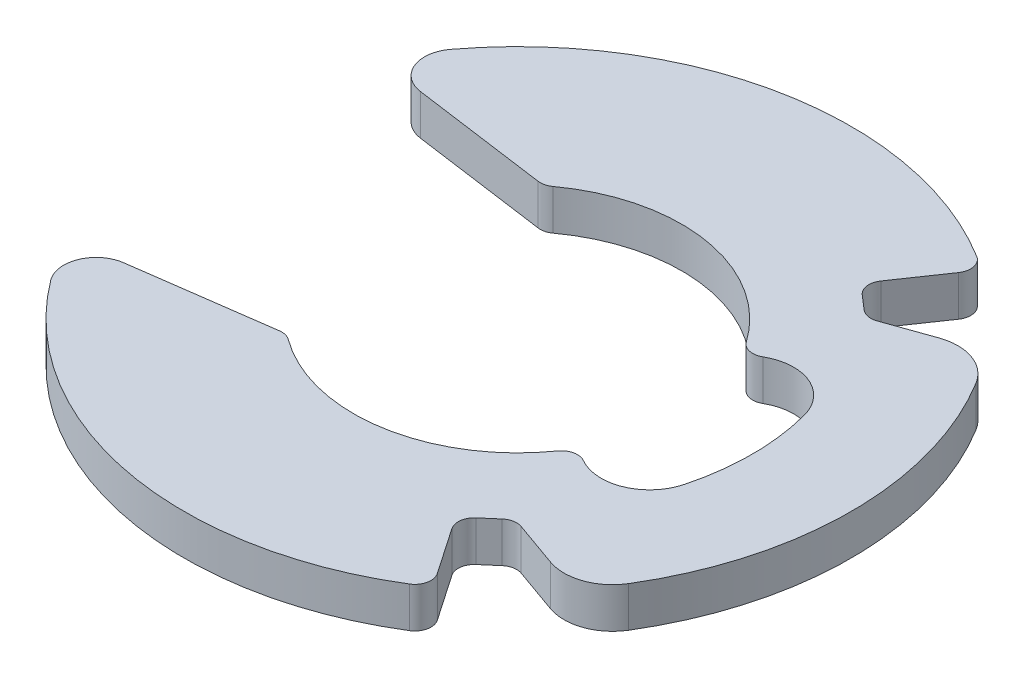
ISO-10303-21;
HEADER;
FILE_DESCRIPTION(('STEP AP214'),'2;1');
FILE_NAME('part.step','',(''),(''),'','','');
FILE_SCHEMA(('AUTOMOTIVE_DESIGN { 1 0 10303 214 1 1 1 1 }'));
ENDSEC;
DATA;
#1=APPLICATION_CONTEXT('core data for automotive mechanical design processes');
#2=APPLICATION_PROTOCOL_DEFINITION('international standard','automotive_design',2000,#1);
#3=PRODUCT_CONTEXT('',#1,'mechanical');
#4=PRODUCT('Part','Part','',(#3));
#5=PRODUCT_RELATED_PRODUCT_CATEGORY('part','',(#4));
#6=PRODUCT_DEFINITION_FORMATION('','',#4);
#7=PRODUCT_DEFINITION_CONTEXT('part definition',#1,'design');
#8=PRODUCT_DEFINITION('design','',#6,#7);
#9=PRODUCT_DEFINITION_SHAPE('','',#8);
#10=(LENGTH_UNIT() NAMED_UNIT(*) SI_UNIT(.MILLI.,.METRE.));
#11=(NAMED_UNIT(*) PLANE_ANGLE_UNIT() SI_UNIT($,.RADIAN.));
#12=(NAMED_UNIT(*) SI_UNIT($,.STERADIAN.) SOLID_ANGLE_UNIT());
#13=UNCERTAINTY_MEASURE_WITH_UNIT(LENGTH_MEASURE(1.E-05),#10,'distance_accuracy_value','');
#14=(GEOMETRIC_REPRESENTATION_CONTEXT(3) GLOBAL_UNCERTAINTY_ASSIGNED_CONTEXT((#13)) GLOBAL_UNIT_ASSIGNED_CONTEXT((#10,
#11,#12)) REPRESENTATION_CONTEXT('',''));
#15=CARTESIAN_POINT('',(0.,0.,0.));
#16=DIRECTION('',(0.,0.,1.));
#17=DIRECTION('',(1.,0.,0.));
#18=AXIS2_PLACEMENT_3D('',#15,#16,#17);
#19=CARTESIAN_POINT('',(-27.3204100145985,1.27,-7.53659958515381));
#20=DIRECTION('',(0.,1.,0.));
#21=DIRECTION('',(0.,0.,1.));
#22=AXIS2_PLACEMENT_3D('',#19,#20,#21);
#23=PLANE('',#22);
#24=DIRECTION('',(-0.56488243359,0.,0.825171398087355));
#25=VECTOR('',#24,1.);
#26=CARTESIAN_POINT('',(-22.6486653223571,1.27,-14.2734191629184));
#27=LINE('',#26,#25);
#28=CARTESIAN_POINT('',(-22.6486653223571,1.27,-14.2734191629184));
#29=VERTEX_POINT('',#28);
#30=CARTESIAN_POINT('',(-21.6539452914442,1.27,-15.7264905806244));
#31=VERTEX_POINT('',#30);
#32=EDGE_CURVE('E236',#29,#31,#27,.F.);
#33=ORIENTED_EDGE('',*,*,#32,.T.);
#34=CARTESIAN_POINT('',(-22.0731323616726,1.27,-16.0134508568881));
#35=DIRECTION('',(0.,-1.,0.));
#36=DIRECTION('',(0.,0.,-1.));
#37=AXIS2_PLACEMENT_3D('',#34,#35,#36);
#38=CIRCLE('',#37,0.507999999999998);
#39=CARTESIAN_POINT('',(-21.805755156428,1.27,-16.4453923229638));
#40=VERTEX_POINT('',#39);
#41=EDGE_CURVE('E217',#40,#31,#38,.T.);
#42=ORIENTED_EDGE('',*,*,#41,.F.);
#43=CARTESIAN_POINT('',(-27.3204100145985,1.27,-7.53659958515381));
#44=DIRECTION('',(0.,-1.,0.));
#45=DIRECTION('',(0.,0.,-1.));
#46=AXIS2_PLACEMENT_3D('',#43,#44,#45);
#47=CIRCLE('',#46,10.4775);
#48=CARTESIAN_POINT('',(-35.7109114644987,1.27,-13.8117483219746));
#49=VERTEX_POINT('',#48);
#50=EDGE_CURVE('E215',#49,#40,#47,.T.);
#51=ORIENTED_EDGE('',*,*,#50,.F.);
#52=CARTESIAN_POINT('',(-34.8972870814781,1.27,-13.2032490505253));
#53=DIRECTION('',(0.,-1.,0.));
#54=DIRECTION('',(0.,0.,-1.));
#55=AXIS2_PLACEMENT_3D('',#52,#53,#54);
#56=CIRCLE('',#55,1.016);
#57=CARTESIAN_POINT('',(-35.0366255018999,1.27,-12.196849127734));
#58=VERTEX_POINT('',#57);
#59=EDGE_CURVE('E20',#58,#49,#56,.T.);
#60=ORIENTED_EDGE('',*,*,#59,.F.);
#61=DIRECTION('',(-0.990551105109562,0.,-0.137144114588364));
#62=VECTOR('',#61,1.);
#63=CARTESIAN_POINT('',(-30.7386620738598,1.27,-11.6017860503912));
#64=LINE('',#63,#62);
#65=CARTESIAN_POINT('',(-30.7386620738598,1.27,-11.6017860503912));
#66=VERTEX_POINT('',#65);
#67=EDGE_CURVE('E232',#58,#66,#64,.F.);
#68=ORIENTED_EDGE('',*,*,#67,.T.);
#69=CARTESIAN_POINT('',(-30.6689928636489,1.27,-12.1049860117869));
#70=DIRECTION('',(0.,-1.,0.));
#71=DIRECTION('',(0.,0.,-1.));
#72=AXIS2_PLACEMENT_3D('',#69,#70,#71);
#73=CIRCLE('',#72,0.508000000000002);
#74=CARTESIAN_POINT('',(-30.3686715318955,1.27,-11.6952652560351));
#75=VERTEX_POINT('',#74);
#76=EDGE_CURVE('E266',#75,#66,#73,.T.);
#77=ORIENTED_EDGE('',*,*,#76,.F.);
#78=CARTESIAN_POINT('',(-27.3204100145985,1.27,-7.53659958515381));
#79=DIRECTION('',(0.,-1.,0.));
#80=DIRECTION('',(0.,0.,-1.));
#81=AXIS2_PLACEMENT_3D('',#78,#79,#80);
#82=CIRCLE('',#81,5.1562);
#83=CARTESIAN_POINT('',(-23.1042244001931,1.27,-10.5047938687007));
#84=VERTEX_POINT('',#83);
#85=EDGE_CURVE('E377',#75,#84,#82,.T.);
#86=ORIENTED_EDGE('',*,*,#85,.T.);
#87=CARTESIAN_POINT('',(-22.6888366549314,1.27,-10.7972268030403));
#88=DIRECTION('',(0.,-1.,0.));
#89=DIRECTION('',(0.,0.,-1.));
#90=AXIS2_PLACEMENT_3D('',#87,#88,#89);
#91=CIRCLE('',#90,0.508);
#92=CARTESIAN_POINT('',(-22.4351958276358,1.27,-10.3570787248566));
#93=VERTEX_POINT('',#92);
#94=EDGE_CURVE('E374',#93,#84,#91,.T.);
#95=ORIENTED_EDGE('',*,*,#94,.F.);
#96=CARTESIAN_POINT('',(-21.6742733457491,1.27,-9.03663449030548));
#97=DIRECTION('',(0.,-1.,0.));
#98=DIRECTION('',(0.,0.,-1.));
#99=AXIS2_PLACEMENT_3D('',#96,#97,#98);
#100=CIRCLE('',#99,1.524);
#101=CARTESIAN_POINT('',(-20.2013681277883,1.27,-9.42794794382331));
#102=VERTEX_POINT('',#101);
#103=EDGE_CURVE('E371',#93,#102,#100,.T.);
#104=ORIENTED_EDGE('',*,*,#103,.T.);
#105=CARTESIAN_POINT('',(-27.3204100145985,1.27,-7.53659958515381));
#106=DIRECTION('',(0.,-1.,0.));
#107=DIRECTION('',(0.,0.,-1.));
#108=AXIS2_PLACEMENT_3D('',#105,#106,#107);
#109=CIRCLE('',#108,7.366);
#110=CARTESIAN_POINT('',(-20.2013681277883,1.27,-5.64525122648429));
#111=VERTEX_POINT('',#110);
#112=EDGE_CURVE('E368',#102,#111,#109,.T.);
#113=ORIENTED_EDGE('',*,*,#112,.T.);
#114=CARTESIAN_POINT('',(-21.6742733457491,1.27,-6.03656468000212));
#115=DIRECTION('',(0.,-1.,0.));
#116=DIRECTION('',(0.,0.,-1.));
#117=AXIS2_PLACEMENT_3D('',#114,#115,#116);
#118=CIRCLE('',#117,1.524);
#119=CARTESIAN_POINT('',(-22.4351958276358,1.27,-4.71612044545101));
#120=VERTEX_POINT('',#119);
#121=EDGE_CURVE('E364',#111,#120,#118,.T.);
#122=ORIENTED_EDGE('',*,*,#121,.T.);
#123=CARTESIAN_POINT('',(-22.6888366549314,1.27,-4.27597236726731));
#124=DIRECTION('',(0.,-1.,0.));
#125=DIRECTION('',(0.,0.,-1.));
#126=AXIS2_PLACEMENT_3D('',#123,#124,#125);
#127=CIRCLE('',#126,0.508);
#128=CARTESIAN_POINT('',(-23.1042244001931,1.27,-4.56840530160691));
#129=VERTEX_POINT('',#128);
#130=EDGE_CURVE('E361',#129,#120,#127,.T.);
#131=ORIENTED_EDGE('',*,*,#130,.F.);
#132=CARTESIAN_POINT('',(-27.3204100145985,1.27,-7.53659958515381));
#133=DIRECTION('',(0.,-1.,0.));
#134=DIRECTION('',(0.,0.,-1.));
#135=AXIS2_PLACEMENT_3D('',#132,#133,#134);
#136=CIRCLE('',#135,5.1562);
#137=CARTESIAN_POINT('',(-30.3686715318955,1.27,-3.37793391427254));
#138=VERTEX_POINT('',#137);
#139=EDGE_CURVE('E357',#129,#138,#136,.T.);
#140=ORIENTED_EDGE('',*,*,#139,.T.);
#141=CARTESIAN_POINT('',(-30.6689928636489,1.27,-2.9682131585207));
#142=DIRECTION('',(0.,-1.,0.));
#143=DIRECTION('',(0.,0.,-1.));
#144=AXIS2_PLACEMENT_3D('',#141,#142,#143);
#145=CIRCLE('',#144,0.508);
#146=CARTESIAN_POINT('',(-30.7386620738598,1.27,-3.47141311991636));
#147=VERTEX_POINT('',#146);
#148=EDGE_CURVE('E354',#147,#138,#145,.T.);
#149=ORIENTED_EDGE('',*,*,#148,.F.);
#150=DIRECTION('',(0.990551105109562,0.,-0.137144114588364));
#151=VECTOR('',#150,1.);
#152=CARTESIAN_POINT('',(-35.0366255018998,1.27,-2.87635004257364));
#153=LINE('',#152,#151);
#154=CARTESIAN_POINT('',(-35.0366255018998,1.27,-2.87635004257364));
#155=VERTEX_POINT('',#154);
#156=EDGE_CURVE('E261',#147,#155,#153,.F.);
#157=ORIENTED_EDGE('',*,*,#156,.T.);
#158=CARTESIAN_POINT('',(-34.8972870814781,1.27,-1.86995011978233));
#159=DIRECTION('',(0.,-1.,0.));
#160=DIRECTION('',(0.,0.,-1.));
#161=AXIS2_PLACEMENT_3D('',#158,#159,#160);
#162=CIRCLE('',#161,1.016);
#163=CARTESIAN_POINT('',(-35.7109114644987,1.27,-1.26145084833304));
#164=VERTEX_POINT('',#163);
#165=EDGE_CURVE('E264',#164,#155,#162,.T.);
#166=ORIENTED_EDGE('',*,*,#165,.F.);
#167=CARTESIAN_POINT('',(-27.3204100145985,1.27,-7.53659958515381));
#168=DIRECTION('',(0.,-1.,0.));
#169=DIRECTION('',(0.,0.,-1.));
#170=AXIS2_PLACEMENT_3D('',#167,#168,#169);
#171=CIRCLE('',#170,10.4775);
#172=CARTESIAN_POINT('',(-21.805755156428,1.27,1.37219315265618));
#173=VERTEX_POINT('',#172);
#174=EDGE_CURVE('E350',#173,#164,#171,.T.);
#175=ORIENTED_EDGE('',*,*,#174,.F.);
#176=CARTESIAN_POINT('',(-22.0731323616726,1.27,0.940251686580542));
#177=DIRECTION('',(0.,-1.,0.));
#178=DIRECTION('',(0.,0.,-1.));
#179=AXIS2_PLACEMENT_3D('',#176,#177,#178);
#180=CIRCLE('',#179,0.508000000000001);
#181=CARTESIAN_POINT('',(-21.6539452914442,1.27,0.653291410316822));
#182=VERTEX_POINT('',#181);
#183=EDGE_CURVE('E346',#182,#173,#180,.T.);
#184=ORIENTED_EDGE('',*,*,#183,.F.);
#185=DIRECTION('',(0.564882433590001,0.,0.825171398087354));
#186=VECTOR('',#185,1.);
#187=CARTESIAN_POINT('',(-22.6486653223571,1.27,-0.79978000738918));
#188=LINE('',#187,#186);
#189=CARTESIAN_POINT('',(-22.6486653223571,1.27,-0.799780007389181));
#190=VERTEX_POINT('',#189);
#191=EDGE_CURVE('E257',#182,#190,#188,.F.);
#192=ORIENTED_EDGE('',*,*,#191,.T.);
#193=CARTESIAN_POINT('',(-22.2294782521287,1.27,-1.0867402836529));
#194=DIRECTION('',(0.,-1.,0.));
#195=DIRECTION('',(0.,0.,-1.));
#196=AXIS2_PLACEMENT_3D('',#193,#194,#195);
#197=CIRCLE('',#196,0.507999999999999);
#198=CARTESIAN_POINT('',(-22.56117158014,1.27,-1.471504544146));
#199=VERTEX_POINT('',#198);
#200=EDGE_CURVE('E344',#190,#199,#197,.T.);
#201=ORIENTED_EDGE('',*,*,#200,.T.);
#202=DIRECTION('',(-0.757409961600577,0.,0.652939622069462));
#203=VECTOR('',#202,1.);
#204=CARTESIAN_POINT('',(-22.1206645642395,1.27,-1.85125197164637));
#205=LINE('',#204,#203);
#206=CARTESIAN_POINT('',(-22.1206645642395,1.27,-1.85125197164637));
#207=VERTEX_POINT('',#206);
#208=EDGE_CURVE('E252',#199,#207,#205,.F.);
#209=ORIENTED_EDGE('',*,*,#208,.T.);
#210=CARTESIAN_POINT('',(-21.7889712362282,1.27,-1.46648771115328));
#211=DIRECTION('',(0.,-1.,0.));
#212=DIRECTION('',(0.,0.,-1.));
#213=AXIS2_PLACEMENT_3D('',#210,#211,#212);
#214=CIRCLE('',#213,0.508);
#215=CARTESIAN_POINT('',(-21.6191707895771,1.27,-1.94526929843193));
#216=VERTEX_POINT('',#215);
#217=EDGE_CURVE('E342',#207,#216,#214,.T.);
#218=ORIENTED_EDGE('',*,*,#217,.T.);
#219=DIRECTION('',(-0.942483439524914,0.,-0.334252847738487));
#220=VECTOR('',#219,1.);
#221=CARTESIAN_POINT('',(-20.1864675997461,1.27,-1.43715944622443));
#222=LINE('',#221,#220);
#223=CARTESIAN_POINT('',(-20.1864675997461,1.27,-1.43715944622443));
#224=VERTEX_POINT('',#223);
#225=EDGE_CURVE('E247',#216,#224,#222,.F.);
#226=ORIENTED_EDGE('',*,*,#225,.T.);
#227=CARTESIAN_POINT('',(-19.6770662597926,1.27,-2.8735042080604));
#228=DIRECTION('',(0.,-1.,0.));
#229=DIRECTION('',(0.,0.,-1.));
#230=AXIS2_PLACEMENT_3D('',#227,#228,#229);
#231=CIRCLE('',#230,1.524);
#232=CARTESIAN_POINT('',(-18.3760715781236,1.27,-2.07978584600195));
#233=VERTEX_POINT('',#232);
#234=EDGE_CURVE('E250',#233,#224,#231,.T.);
#235=ORIENTED_EDGE('',*,*,#234,.F.);
#236=CARTESIAN_POINT('',(-27.3204100145985,1.27,-7.53659958515381));
#237=DIRECTION('',(0.,-1.,0.));
#238=DIRECTION('',(0.,0.,-1.));
#239=AXIS2_PLACEMENT_3D('',#236,#237,#238);
#240=CIRCLE('',#239,10.4775);
#241=CARTESIAN_POINT('',(-18.3760715781235,1.27,-12.9934133243057));
#242=VERTEX_POINT('',#241);
#243=EDGE_CURVE('E337',#242,#233,#240,.T.);
#244=ORIENTED_EDGE('',*,*,#243,.F.);
#245=CARTESIAN_POINT('',(-19.6770662597926,1.27,-12.1996949622472));
#246=DIRECTION('',(0.,-1.,0.));
#247=DIRECTION('',(0.,0.,-1.));
#248=AXIS2_PLACEMENT_3D('',#245,#246,#247);
#249=CIRCLE('',#248,1.524);
#250=CARTESIAN_POINT('',(-20.1864675997461,1.27,-13.6360397240832));
#251=VERTEX_POINT('',#250);
#252=EDGE_CURVE('E334',#251,#242,#249,.T.);
#253=ORIENTED_EDGE('',*,*,#252,.F.);
#254=DIRECTION('',(0.942483439524914,0.,-0.334252847738487));
#255=VECTOR('',#254,1.);
#256=CARTESIAN_POINT('',(-20.1864675997461,1.27,-13.6360397240832));
#257=LINE('',#256,#255);
#258=CARTESIAN_POINT('',(-21.6191707895771,1.27,-13.1279298718757));
#259=VERTEX_POINT('',#258);
#260=EDGE_CURVE('E243',#251,#259,#257,.F.);
#261=ORIENTED_EDGE('',*,*,#260,.T.);
#262=CARTESIAN_POINT('',(-21.7889712362282,1.27,-13.6067114591543));
#263=DIRECTION('',(0.,-1.,0.));
#264=DIRECTION('',(0.,0.,-1.));
#265=AXIS2_PLACEMENT_3D('',#262,#263,#264);
#266=CIRCLE('',#265,0.508000000000002);
#267=CARTESIAN_POINT('',(-22.1206645642395,1.27,-13.2219471986612));
#268=VERTEX_POINT('',#267);
#269=EDGE_CURVE('E332',#259,#268,#266,.T.);
#270=ORIENTED_EDGE('',*,*,#269,.T.);
#271=DIRECTION('',(0.757409961600575,0.,0.652939622069465));
#272=VECTOR('',#271,1.);
#273=CARTESIAN_POINT('',(-22.1206645642395,1.27,-13.2219471986612));
#274=LINE('',#273,#272);
#275=CARTESIAN_POINT('',(-22.56117158014,1.27,-13.6016946261616));
#276=VERTEX_POINT('',#275);
#277=EDGE_CURVE('E239',#268,#276,#274,.F.);
#278=ORIENTED_EDGE('',*,*,#277,.T.);
#279=CARTESIAN_POINT('',(-22.2294782521287,1.27,-13.9864588866547));
#280=DIRECTION('',(0.,-1.,0.));
#281=DIRECTION('',(0.,0.,-1.));
#282=AXIS2_PLACEMENT_3D('',#279,#280,#281);
#283=CIRCLE('',#282,0.508);
#284=EDGE_CURVE('E330',#276,#29,#283,.T.);
#285=ORIENTED_EDGE('',*,*,#284,.T.);
#286=EDGE_LOOP('',(#33,#42,#51,#60,#68,#77,#86,#95,#104,#113,#122,#131,#140,#149,#157,#166,#175,
#184,#192,#201,#209,#218,#226,#235,#244,#253,#261,#270,#278,#285));
#287=FACE_BOUND('',#286,.T.);
#288=ADVANCED_FACE('F17',(#287),#23,.T.);
#289=CARTESIAN_POINT('',(-34.8972870814781,1.27,-13.2032490505253));
#290=DIRECTION('',(0.,-1.,0.));
#291=DIRECTION('',(0.,0.,-1.));
#292=AXIS2_PLACEMENT_3D('',#289,#290,#291);
#293=CYLINDRICAL_SURFACE('',#292,1.016);
#294=ORIENTED_EDGE('',*,*,#59,.T.);
#295=DIRECTION('',(0.,-1.,0.));
#296=VECTOR('',#295,1.);
#297=CARTESIAN_POINT('',(-35.7109114644987,1.27,-13.8117483219746));
#298=LINE('',#297,#296);
#299=CARTESIAN_POINT('',(-35.7109114644987,0.,-13.8117483219746));
#300=VERTEX_POINT('',#299);
#301=EDGE_CURVE('E228',#49,#300,#298,.T.);
#302=ORIENTED_EDGE('',*,*,#301,.T.);
#303=CARTESIAN_POINT('',(-34.8972870814781,0.,-13.2032490505253));
#304=DIRECTION('',(0.,-1.,0.));
#305=DIRECTION('',(0.,0.,-1.));
#306=AXIS2_PLACEMENT_3D('',#303,#304,#305);
#307=CIRCLE('',#306,1.016);
#308=CARTESIAN_POINT('',(-35.0366255018999,0.,-12.196849127734));
#309=VERTEX_POINT('',#308);
#310=EDGE_CURVE('E326',#300,#309,#307,.F.);
#311=ORIENTED_EDGE('',*,*,#310,.T.);
#312=DIRECTION('',(0.,1.,0.));
#313=VECTOR('',#312,1.);
#314=CARTESIAN_POINT('',(-35.0366255018999,1.27,-12.196849127734));
#315=LINE('',#314,#313);
#316=EDGE_CURVE('E229',#309,#58,#315,.T.);
#317=ORIENTED_EDGE('',*,*,#316,.T.);
#318=EDGE_LOOP('',(#294,#302,#311,#317));
#319=FACE_BOUND('',#318,.T.);
#320=ADVANCED_FACE('F226',(#319),#293,.T.);
#321=CARTESIAN_POINT('',(-30.7386620738598,1.27,-11.6017860503912));
#322=DIRECTION('',(0.137144114588364,0.,-0.990551105109562));
#323=DIRECTION('',(-0.990551105109562,0.,-0.137144114588364));
#324=AXIS2_PLACEMENT_3D('',#321,#322,#323);
#325=PLANE('',#324);
#326=DIRECTION('',(0.,-1.,0.));
#327=VECTOR('',#326,1.);
#328=CARTESIAN_POINT('',(-30.7386620738598,1.27,-11.6017860503912));
#329=LINE('',#328,#327);
#330=CARTESIAN_POINT('',(-30.7386620738598,0.,-11.6017860503912));
#331=VERTEX_POINT('',#330);
#332=EDGE_CURVE('E380',#66,#331,#329,.T.);
#333=ORIENTED_EDGE('',*,*,#332,.F.);
#334=ORIENTED_EDGE('',*,*,#67,.F.);
#335=ORIENTED_EDGE('',*,*,#316,.F.);
#336=DIRECTION('',(0.990551105109562,0.,0.137144114588364));
#337=VECTOR('',#336,1.);
#338=CARTESIAN_POINT('',(-35.0366255018999,0.,-12.196849127734));
#339=LINE('',#338,#337);
#340=EDGE_CURVE('E325',#309,#331,#339,.T.);
#341=ORIENTED_EDGE('',*,*,#340,.T.);
#342=EDGE_LOOP('',(#333,#334,#335,#341));
#343=FACE_BOUND('',#342,.T.);
#344=ADVANCED_FACE('F555',(#343),#325,.F.);
#345=CARTESIAN_POINT('',(-30.6689928636489,1.27,-12.1049860117869));
#346=DIRECTION('',(0.,-1.,0.));
#347=DIRECTION('',(0.,0.,-1.));
#348=AXIS2_PLACEMENT_3D('',#345,#346,#347);
#349=CYLINDRICAL_SURFACE('',#348,0.508000000000002);
#350=ORIENTED_EDGE('',*,*,#76,.T.);
#351=ORIENTED_EDGE('',*,*,#332,.T.);
#352=CARTESIAN_POINT('',(-30.6689928636489,0.,-12.1049860117869));
#353=DIRECTION('',(0.,-1.,0.));
#354=DIRECTION('',(0.,0.,-1.));
#355=AXIS2_PLACEMENT_3D('',#352,#353,#354);
#356=CIRCLE('',#355,0.508000000000002);
#357=CARTESIAN_POINT('',(-30.3686715318955,0.,-11.6952652560351));
#358=VERTEX_POINT('',#357);
#359=EDGE_CURVE('E322',#331,#358,#356,.F.);
#360=ORIENTED_EDGE('',*,*,#359,.T.);
#361=DIRECTION('',(0.,-1.,0.));
#362=VECTOR('',#361,1.);
#363=CARTESIAN_POINT('',(-30.3686715318955,1.27,-11.6952652560351));
#364=LINE('',#363,#362);
#365=EDGE_CURVE('E379',#358,#75,#364,.F.);
#366=ORIENTED_EDGE('',*,*,#365,.T.);
#367=EDGE_LOOP('',(#350,#351,#360,#366));
#368=FACE_BOUND('',#367,.T.);
#369=ADVANCED_FACE('F553',(#368),#349,.T.);
#370=CARTESIAN_POINT('',(-27.3204100145985,1.27,-7.53659958515381));
#371=DIRECTION('',(0.,-1.,0.));
#372=DIRECTION('',(0.,0.,-1.));
#373=AXIS2_PLACEMENT_3D('',#370,#371,#372);
#374=CYLINDRICAL_SURFACE('',#373,5.1562);
#375=ORIENTED_EDGE('',*,*,#85,.F.);
#376=ORIENTED_EDGE('',*,*,#365,.F.);
#377=CARTESIAN_POINT('',(-27.3204100145985,0.,-7.53659958515381));
#378=DIRECTION('',(0.,-1.,0.));
#379=DIRECTION('',(0.,0.,-1.));
#380=AXIS2_PLACEMENT_3D('',#377,#378,#379);
#381=CIRCLE('',#380,5.1562);
#382=CARTESIAN_POINT('',(-23.1042244001931,0.,-10.5047938687007));
#383=VERTEX_POINT('',#382);
#384=EDGE_CURVE('E320',#358,#383,#381,.T.);
#385=ORIENTED_EDGE('',*,*,#384,.T.);
#386=DIRECTION('',(0.,-1.,0.));
#387=VECTOR('',#386,1.);
#388=CARTESIAN_POINT('',(-23.1042244001931,1.27,-10.5047938687007));
#389=LINE('',#388,#387);
#390=EDGE_CURVE('E376',#84,#383,#389,.T.);
#391=ORIENTED_EDGE('',*,*,#390,.F.);
#392=EDGE_LOOP('',(#375,#376,#385,#391));
#393=FACE_BOUND('',#392,.T.);
#394=ADVANCED_FACE('F551',(#393),#374,.F.);
#395=CARTESIAN_POINT('',(-22.6888366549314,1.27,-10.7972268030403));
#396=DIRECTION('',(0.,-1.,0.));
#397=DIRECTION('',(0.,0.,-1.));
#398=AXIS2_PLACEMENT_3D('',#395,#396,#397);
#399=CYLINDRICAL_SURFACE('',#398,0.508);
#400=ORIENTED_EDGE('',*,*,#94,.T.);
#401=ORIENTED_EDGE('',*,*,#390,.T.);
#402=CARTESIAN_POINT('',(-22.6888366549314,0.,-10.7972268030403));
#403=DIRECTION('',(0.,-1.,0.));
#404=DIRECTION('',(0.,0.,-1.));
#405=AXIS2_PLACEMENT_3D('',#402,#403,#404);
#406=CIRCLE('',#405,0.508);
#407=CARTESIAN_POINT('',(-22.4351958276358,0.,-10.3570787248566));
#408=VERTEX_POINT('',#407);
#409=EDGE_CURVE('E317',#383,#408,#406,.F.);
#410=ORIENTED_EDGE('',*,*,#409,.T.);
#411=DIRECTION('',(0.,-1.,0.));
#412=VECTOR('',#411,1.);
#413=CARTESIAN_POINT('',(-22.4351958276358,1.27,-10.3570787248566));
#414=LINE('',#413,#412);
#415=EDGE_CURVE('E373',#408,#93,#414,.F.);
#416=ORIENTED_EDGE('',*,*,#415,.T.);
#417=EDGE_LOOP('',(#400,#401,#410,#416));
#418=FACE_BOUND('',#417,.T.);
#419=ADVANCED_FACE('F547',(#418),#399,.T.);
#420=CARTESIAN_POINT('',(-21.6742733457491,1.27,-9.03663449030548));
#421=DIRECTION('',(0.,-1.,0.));
#422=DIRECTION('',(0.,0.,-1.));
#423=AXIS2_PLACEMENT_3D('',#420,#421,#422);
#424=CYLINDRICAL_SURFACE('',#423,1.524);
#425=ORIENTED_EDGE('',*,*,#103,.F.);
#426=ORIENTED_EDGE('',*,*,#415,.F.);
#427=CARTESIAN_POINT('',(-21.6742733457491,0.,-9.03663449030548));
#428=DIRECTION('',(0.,-1.,0.));
#429=DIRECTION('',(0.,0.,-1.));
#430=AXIS2_PLACEMENT_3D('',#427,#428,#429);
#431=CIRCLE('',#430,1.524);
#432=CARTESIAN_POINT('',(-20.2013681277883,0.,-9.42794794382331));
#433=VERTEX_POINT('',#432);
#434=EDGE_CURVE('E315',#408,#433,#431,.T.);
#435=ORIENTED_EDGE('',*,*,#434,.T.);
#436=DIRECTION('',(0.,-1.,0.));
#437=VECTOR('',#436,1.);
#438=CARTESIAN_POINT('',(-20.2013681277883,1.27,-9.42794794382331));
#439=LINE('',#438,#437);
#440=EDGE_CURVE('E370',#433,#102,#439,.F.);
#441=ORIENTED_EDGE('',*,*,#440,.T.);
#442=EDGE_LOOP('',(#425,#426,#435,#441));
#443=FACE_BOUND('',#442,.T.);
#444=ADVANCED_FACE('F621',(#443),#424,.F.);
#445=CARTESIAN_POINT('',(-27.3204100145985,1.27,-7.53659958515381));
#446=DIRECTION('',(0.,-1.,0.));
#447=DIRECTION('',(0.,0.,-1.));
#448=AXIS2_PLACEMENT_3D('',#445,#446,#447);
#449=CYLINDRICAL_SURFACE('',#448,7.366);
#450=DIRECTION('',(0.,-1.,0.));
#451=VECTOR('',#450,1.);
#452=CARTESIAN_POINT('',(-20.2013681277883,1.27,-5.64525122648429));
#453=LINE('',#452,#451);
#454=CARTESIAN_POINT('',(-20.2013681277883,0.,-5.64525122648429));
#455=VERTEX_POINT('',#454);
#456=EDGE_CURVE('E367',#455,#111,#453,.F.);
#457=ORIENTED_EDGE('',*,*,#456,.T.);
#458=ORIENTED_EDGE('',*,*,#112,.F.);
#459=ORIENTED_EDGE('',*,*,#440,.F.);
#460=CARTESIAN_POINT('',(-27.3204100145985,0.,-7.53659958515381));
#461=DIRECTION('',(0.,-1.,0.));
#462=DIRECTION('',(0.,0.,-1.));
#463=AXIS2_PLACEMENT_3D('',#460,#461,#462);
#464=CIRCLE('',#463,7.366);
#465=EDGE_CURVE('E312',#433,#455,#464,.T.);
#466=ORIENTED_EDGE('',*,*,#465,.T.);
#467=EDGE_LOOP('',(#457,#458,#459,#466));
#468=FACE_BOUND('',#467,.T.);
#469=ADVANCED_FACE('F540',(#468),#449,.F.);
#470=CARTESIAN_POINT('',(-21.6742733457491,1.27,-6.03656468000212));
#471=DIRECTION('',(0.,-1.,0.));
#472=DIRECTION('',(0.,0.,-1.));
#473=AXIS2_PLACEMENT_3D('',#470,#471,#472);
#474=CYLINDRICAL_SURFACE('',#473,1.524);
#475=DIRECTION('',(0.,-1.,0.));
#476=VECTOR('',#475,1.);
#477=CARTESIAN_POINT('',(-22.4351958276358,1.27,-4.71612044545101));
#478=LINE('',#477,#476);
#479=CARTESIAN_POINT('',(-22.4351958276358,0.,-4.71612044545101));
#480=VERTEX_POINT('',#479);
#481=EDGE_CURVE('E363',#120,#480,#478,.T.);
#482=ORIENTED_EDGE('',*,*,#481,.F.);
#483=ORIENTED_EDGE('',*,*,#121,.F.);
#484=ORIENTED_EDGE('',*,*,#456,.F.);
#485=CARTESIAN_POINT('',(-21.6742733457491,0.,-6.03656468000212));
#486=DIRECTION('',(0.,-1.,0.));
#487=DIRECTION('',(0.,0.,-1.));
#488=AXIS2_PLACEMENT_3D('',#485,#486,#487);
#489=CIRCLE('',#488,1.524);
#490=EDGE_CURVE('E309',#455,#480,#489,.T.);
#491=ORIENTED_EDGE('',*,*,#490,.T.);
#492=EDGE_LOOP('',(#482,#483,#484,#491));
#493=FACE_BOUND('',#492,.T.);
#494=ADVANCED_FACE('F536',(#493),#474,.F.);
#495=CARTESIAN_POINT('',(-22.6888366549314,1.27,-4.27597236726731));
#496=DIRECTION('',(0.,-1.,0.));
#497=DIRECTION('',(0.,0.,-1.));
#498=AXIS2_PLACEMENT_3D('',#495,#496,#497);
#499=CYLINDRICAL_SURFACE('',#498,0.508);
#500=CARTESIAN_POINT('',(-22.6888366549314,0.,-4.27597236726731));
#501=DIRECTION('',(0.,-1.,0.));
#502=DIRECTION('',(0.,0.,-1.));
#503=AXIS2_PLACEMENT_3D('',#500,#501,#502);
#504=CIRCLE('',#503,0.508);
#505=CARTESIAN_POINT('',(-23.1042244001931,0.,-4.56840530160691));
#506=VERTEX_POINT('',#505);
#507=EDGE_CURVE('E307',#480,#506,#504,.F.);
#508=ORIENTED_EDGE('',*,*,#507,.T.);
#509=DIRECTION('',(0.,-1.,0.));
#510=VECTOR('',#509,1.);
#511=CARTESIAN_POINT('',(-23.1042244001931,1.27,-4.56840530160691));
#512=LINE('',#511,#510);
#513=EDGE_CURVE('E360',#506,#129,#512,.F.);
#514=ORIENTED_EDGE('',*,*,#513,.T.);
#515=ORIENTED_EDGE('',*,*,#130,.T.);
#516=ORIENTED_EDGE('',*,*,#481,.T.);
#517=EDGE_LOOP('',(#508,#514,#515,#516));
#518=FACE_BOUND('',#517,.T.);
#519=ADVANCED_FACE('F531',(#518),#499,.T.);
#520=CARTESIAN_POINT('',(-27.3204100145985,1.27,-7.53659958515381));
#521=DIRECTION('',(0.,-1.,0.));
#522=DIRECTION('',(0.,0.,-1.));
#523=AXIS2_PLACEMENT_3D('',#520,#521,#522);
#524=CYLINDRICAL_SURFACE('',#523,5.1562);
#525=DIRECTION('',(0.,-1.,0.));
#526=VECTOR('',#525,1.);
#527=CARTESIAN_POINT('',(-30.3686715318955,1.27,-3.37793391427254));
#528=LINE('',#527,#526);
#529=CARTESIAN_POINT('',(-30.3686715318955,0.,-3.37793391427254));
#530=VERTEX_POINT('',#529);
#531=EDGE_CURVE('E356',#138,#530,#528,.T.);
#532=ORIENTED_EDGE('',*,*,#531,.F.);
#533=ORIENTED_EDGE('',*,*,#139,.F.);
#534=ORIENTED_EDGE('',*,*,#513,.F.);
#535=CARTESIAN_POINT('',(-27.3204100145985,0.,-7.53659958515381));
#536=DIRECTION('',(0.,-1.,0.));
#537=DIRECTION('',(0.,0.,-1.));
#538=AXIS2_PLACEMENT_3D('',#535,#536,#537);
#539=CIRCLE('',#538,5.1562);
#540=EDGE_CURVE('E304',#506,#530,#539,.T.);
#541=ORIENTED_EDGE('',*,*,#540,.T.);
#542=EDGE_LOOP('',(#532,#533,#534,#541));
#543=FACE_BOUND('',#542,.T.);
#544=ADVANCED_FACE('F528',(#543),#524,.F.);
#545=CARTESIAN_POINT('',(-30.6689928636489,1.27,-2.9682131585207));
#546=DIRECTION('',(0.,-1.,0.));
#547=DIRECTION('',(0.,0.,-1.));
#548=AXIS2_PLACEMENT_3D('',#545,#546,#547);
#549=CYLINDRICAL_SURFACE('',#548,0.508);
#550=CARTESIAN_POINT('',(-30.6689928636489,0.,-2.9682131585207));
#551=DIRECTION('',(0.,-1.,0.));
#552=DIRECTION('',(0.,0.,-1.));
#553=AXIS2_PLACEMENT_3D('',#550,#551,#552);
#554=CIRCLE('',#553,0.508);
#555=CARTESIAN_POINT('',(-30.7386620738598,0.,-3.47141311991636));
#556=VERTEX_POINT('',#555);
#557=EDGE_CURVE('E302',#530,#556,#554,.F.);
#558=ORIENTED_EDGE('',*,*,#557,.T.);
#559=DIRECTION('',(0.,1.,0.));
#560=VECTOR('',#559,1.);
#561=CARTESIAN_POINT('',(-30.7386620738598,1.27,-3.47141311991636));
#562=LINE('',#561,#560);
#563=EDGE_CURVE('E265',#556,#147,#562,.T.);
#564=ORIENTED_EDGE('',*,*,#563,.T.);
#565=ORIENTED_EDGE('',*,*,#148,.T.);
#566=ORIENTED_EDGE('',*,*,#531,.T.);
#567=EDGE_LOOP('',(#558,#564,#565,#566));
#568=FACE_BOUND('',#567,.T.);
#569=ADVANCED_FACE('F522',(#568),#549,.T.);
#570=CARTESIAN_POINT('',(-35.0366255018998,1.27,-2.87635004257364));
#571=DIRECTION('',(0.137144114588364,0.,0.990551105109562));
#572=DIRECTION('',(0.990551105109562,0.,-0.137144114588364));
#573=AXIS2_PLACEMENT_3D('',#570,#571,#572);
#574=PLANE('',#573);
#575=DIRECTION('',(0.,-1.,0.));
#576=VECTOR('',#575,1.);
#577=CARTESIAN_POINT('',(-35.0366255018998,1.27,-2.87635004257364));
#578=LINE('',#577,#576);
#579=CARTESIAN_POINT('',(-35.0366255018998,0.,-2.87635004257364));
#580=VERTEX_POINT('',#579);
#581=EDGE_CURVE('E352',#155,#580,#578,.T.);
#582=ORIENTED_EDGE('',*,*,#581,.F.);
#583=ORIENTED_EDGE('',*,*,#156,.F.);
#584=ORIENTED_EDGE('',*,*,#563,.F.);
#585=DIRECTION('',(-0.990551105109562,0.,0.137144114588363));
#586=VECTOR('',#585,1.);
#587=CARTESIAN_POINT('',(-30.7386620738598,0.,-3.47141311991635));
#588=LINE('',#587,#586);
#589=EDGE_CURVE('E301',#556,#580,#588,.T.);
#590=ORIENTED_EDGE('',*,*,#589,.T.);
#591=EDGE_LOOP('',(#582,#583,#584,#590));
#592=FACE_BOUND('',#591,.T.);
#593=ADVANCED_FACE('F519',(#592),#574,.F.);
#594=CARTESIAN_POINT('',(-34.8972870814781,1.27,-1.86995011978233));
#595=DIRECTION('',(0.,-1.,0.));
#596=DIRECTION('',(0.,0.,-1.));
#597=AXIS2_PLACEMENT_3D('',#594,#595,#596);
#598=CYLINDRICAL_SURFACE('',#597,1.016);
#599=ORIENTED_EDGE('',*,*,#165,.T.);
#600=ORIENTED_EDGE('',*,*,#581,.T.);
#601=CARTESIAN_POINT('',(-34.8972870814781,0.,-1.86995011978233));
#602=DIRECTION('',(0.,-1.,0.));
#603=DIRECTION('',(0.,0.,-1.));
#604=AXIS2_PLACEMENT_3D('',#601,#602,#603);
#605=CIRCLE('',#604,1.016);
#606=CARTESIAN_POINT('',(-35.7109114644987,0.,-1.26145084833304));
#607=VERTEX_POINT('',#606);
#608=EDGE_CURVE('E298',#580,#607,#605,.F.);
#609=ORIENTED_EDGE('',*,*,#608,.T.);
#610=DIRECTION('',(0.,-1.,0.));
#611=VECTOR('',#610,1.);
#612=CARTESIAN_POINT('',(-35.7109114644987,1.27,-1.26145084833303));
#613=LINE('',#612,#611);
#614=EDGE_CURVE('E349',#164,#607,#613,.T.);
#615=ORIENTED_EDGE('',*,*,#614,.F.);
#616=EDGE_LOOP('',(#599,#600,#609,#615));
#617=FACE_BOUND('',#616,.T.);
#618=ADVANCED_FACE('F513',(#617),#598,.T.);
#619=CARTESIAN_POINT('',(-27.3204100145985,1.27,-7.53659958515381));
#620=DIRECTION('',(0.,-1.,0.));
#621=DIRECTION('',(0.,0.,-1.));
#622=AXIS2_PLACEMENT_3D('',#619,#620,#621);
#623=CYLINDRICAL_SURFACE('',#622,10.4775);
#624=ORIENTED_EDGE('',*,*,#174,.T.);
#625=ORIENTED_EDGE('',*,*,#614,.T.);
#626=CARTESIAN_POINT('',(-27.3204100145985,0.,-7.53659958515381));
#627=DIRECTION('',(0.,-1.,0.));
#628=DIRECTION('',(0.,0.,-1.));
#629=AXIS2_PLACEMENT_3D('',#626,#627,#628);
#630=CIRCLE('',#629,10.4775);
#631=CARTESIAN_POINT('',(-21.805755156428,0.,1.37219315265618));
#632=VERTEX_POINT('',#631);
#633=EDGE_CURVE('E295',#607,#632,#630,.F.);
#634=ORIENTED_EDGE('',*,*,#633,.T.);
#635=DIRECTION('',(0.,-1.,0.));
#636=VECTOR('',#635,1.);
#637=CARTESIAN_POINT('',(-21.805755156428,1.27,1.37219315265618));
#638=LINE('',#637,#636);
#639=EDGE_CURVE('E348',#173,#632,#638,.T.);
#640=ORIENTED_EDGE('',*,*,#639,.F.);
#641=EDGE_LOOP('',(#624,#625,#634,#640));
#642=FACE_BOUND('',#641,.T.);
#643=ADVANCED_FACE('F509',(#642),#623,.T.);
#644=CARTESIAN_POINT('',(-22.0731323616726,1.27,0.940251686580542));
#645=DIRECTION('',(0.,-1.,0.));
#646=DIRECTION('',(0.,0.,-1.));
#647=AXIS2_PLACEMENT_3D('',#644,#645,#646);
#648=CYLINDRICAL_SURFACE('',#647,0.508000000000001);
#649=ORIENTED_EDGE('',*,*,#183,.T.);
#650=ORIENTED_EDGE('',*,*,#639,.T.);
#651=CARTESIAN_POINT('',(-22.0731323616726,0.,0.940251686580542));
#652=DIRECTION('',(0.,-1.,0.));
#653=DIRECTION('',(0.,0.,-1.));
#654=AXIS2_PLACEMENT_3D('',#651,#652,#653);
#655=CIRCLE('',#654,0.508000000000001);
#656=CARTESIAN_POINT('',(-21.6539452914442,0.,0.653291410316822));
#657=VERTEX_POINT('',#656);
#658=EDGE_CURVE('E292',#632,#657,#655,.F.);
#659=ORIENTED_EDGE('',*,*,#658,.T.);
#660=DIRECTION('',(0.,1.,0.));
#661=VECTOR('',#660,1.);
#662=CARTESIAN_POINT('',(-21.6539452914442,1.27,0.653291410316824));
#663=LINE('',#662,#661);
#664=EDGE_CURVE('E260',#657,#182,#663,.T.);
#665=ORIENTED_EDGE('',*,*,#664,.T.);
#666=EDGE_LOOP('',(#649,#650,#659,#665));
#667=FACE_BOUND('',#666,.T.);
#668=ADVANCED_FACE('F503',(#667),#648,.T.);
#669=CARTESIAN_POINT('',(-22.6486653223571,1.27,-0.79978000738918));
#670=DIRECTION('',(-0.825171398087354,0.,0.564882433590001));
#671=DIRECTION('',(0.564882433590001,0.,0.825171398087354));
#672=AXIS2_PLACEMENT_3D('',#669,#670,#671);
#673=PLANE('',#672);
#674=DIRECTION('',(0.,-1.,0.));
#675=VECTOR('',#674,1.);
#676=CARTESIAN_POINT('',(-22.6486653223571,1.27,-0.79978000738918));
#677=LINE('',#676,#675);
#678=CARTESIAN_POINT('',(-22.6486653223571,0.,-0.799780007389181));
#679=VERTEX_POINT('',#678);
#680=EDGE_CURVE('E259',#679,#190,#677,.F.);
#681=ORIENTED_EDGE('',*,*,#680,.T.);
#682=ORIENTED_EDGE('',*,*,#191,.F.);
#683=ORIENTED_EDGE('',*,*,#664,.F.);
#684=DIRECTION('',(-0.564882433590001,0.,-0.825171398087354));
#685=VECTOR('',#684,1.);
#686=CARTESIAN_POINT('',(-21.6539452914442,0.,0.653291410316824));
#687=LINE('',#686,#685);
#688=EDGE_CURVE('E291',#657,#679,#687,.T.);
#689=ORIENTED_EDGE('',*,*,#688,.T.);
#690=EDGE_LOOP('',(#681,#682,#683,#689));
#691=FACE_BOUND('',#690,.T.);
#692=ADVANCED_FACE('F500',(#691),#673,.F.);
#693=CARTESIAN_POINT('',(-22.2294782521287,1.27,-1.0867402836529));
#694=DIRECTION('',(0.,-1.,0.));
#695=DIRECTION('',(0.,0.,-1.));
#696=AXIS2_PLACEMENT_3D('',#693,#694,#695);
#697=CYLINDRICAL_SURFACE('',#696,0.507999999999999);
#698=DIRECTION('',(0.,1.,0.));
#699=VECTOR('',#698,1.);
#700=CARTESIAN_POINT('',(-22.56117158014,1.27,-1.471504544146));
#701=LINE('',#700,#699);
#702=CARTESIAN_POINT('',(-22.56117158014,0.,-1.471504544146));
#703=VERTEX_POINT('',#702);
#704=EDGE_CURVE('E256',#703,#199,#701,.T.);
#705=ORIENTED_EDGE('',*,*,#704,.T.);
#706=ORIENTED_EDGE('',*,*,#200,.F.);
#707=ORIENTED_EDGE('',*,*,#680,.F.);
#708=CARTESIAN_POINT('',(-22.2294782521287,0.,-1.0867402836529));
#709=DIRECTION('',(0.,-1.,0.));
#710=DIRECTION('',(0.,0.,-1.));
#711=AXIS2_PLACEMENT_3D('',#708,#709,#710);
#712=CIRCLE('',#711,0.507999999999999);
#713=EDGE_CURVE('E288',#679,#703,#712,.T.);
#714=ORIENTED_EDGE('',*,*,#713,.T.);
#715=EDGE_LOOP('',(#705,#706,#707,#714));
#716=FACE_BOUND('',#715,.T.);
#717=ADVANCED_FACE('F496',(#716),#697,.F.);
#718=CARTESIAN_POINT('',(-22.1206645642395,1.27,-1.85125197164637));
#719=DIRECTION('',(-0.652939622069462,0.,-0.757409961600577));
#720=DIRECTION('',(-0.757409961600577,0.,0.652939622069462));
#721=AXIS2_PLACEMENT_3D('',#718,#719,#720);
#722=PLANE('',#721);
#723=DIRECTION('',(0.,-1.,0.));
#724=VECTOR('',#723,1.);
#725=CARTESIAN_POINT('',(-22.1206645642395,1.27,-1.85125197164637));
#726=LINE('',#725,#724);
#727=CARTESIAN_POINT('',(-22.1206645642395,0.,-1.85125197164637));
#728=VERTEX_POINT('',#727);
#729=EDGE_CURVE('E255',#728,#207,#726,.F.);
#730=ORIENTED_EDGE('',*,*,#729,.T.);
#731=ORIENTED_EDGE('',*,*,#208,.F.);
#732=ORIENTED_EDGE('',*,*,#704,.F.);
#733=DIRECTION('',(0.757409961600577,0.,-0.652939622069463));
#734=VECTOR('',#733,1.);
#735=CARTESIAN_POINT('',(-22.56117158014,0.,-1.471504544146));
#736=LINE('',#735,#734);
#737=EDGE_CURVE('E287',#703,#728,#736,.T.);
#738=ORIENTED_EDGE('',*,*,#737,.T.);
#739=EDGE_LOOP('',(#730,#731,#732,#738));
#740=FACE_BOUND('',#739,.T.);
#741=ADVANCED_FACE('F492',(#740),#722,.F.);
#742=CARTESIAN_POINT('',(-21.7889712362282,1.27,-1.46648771115328));
#743=DIRECTION('',(0.,-1.,0.));
#744=DIRECTION('',(0.,0.,-1.));
#745=AXIS2_PLACEMENT_3D('',#742,#743,#744);
#746=CYLINDRICAL_SURFACE('',#745,0.508);
#747=ORIENTED_EDGE('',*,*,#217,.F.);
#748=ORIENTED_EDGE('',*,*,#729,.F.);
#749=CARTESIAN_POINT('',(-21.7889712362282,0.,-1.46648771115328));
#750=DIRECTION('',(0.,-1.,0.));
#751=DIRECTION('',(0.,0.,-1.));
#752=AXIS2_PLACEMENT_3D('',#749,#750,#751);
#753=CIRCLE('',#752,0.508);
#754=CARTESIAN_POINT('',(-21.6191707895771,0.,-1.94526929843193));
#755=VERTEX_POINT('',#754);
#756=EDGE_CURVE('E285',#728,#755,#753,.T.);
#757=ORIENTED_EDGE('',*,*,#756,.T.);
#758=DIRECTION('',(0.,1.,0.));
#759=VECTOR('',#758,1.);
#760=CARTESIAN_POINT('',(-21.6191707895771,1.27,-1.94526929843193));
#761=LINE('',#760,#759);
#762=EDGE_CURVE('E251',#755,#216,#761,.T.);
#763=ORIENTED_EDGE('',*,*,#762,.T.);
#764=EDGE_LOOP('',(#747,#748,#757,#763));
#765=FACE_BOUND('',#764,.T.);
#766=ADVANCED_FACE('F488',(#765),#746,.F.);
#767=CARTESIAN_POINT('',(-20.1864675997461,1.27,-1.43715944622443));
#768=DIRECTION('',(0.334252847738487,0.,-0.942483439524914));
#769=DIRECTION('',(-0.942483439524914,0.,-0.334252847738487));
#770=AXIS2_PLACEMENT_3D('',#767,#768,#769);
#771=PLANE('',#770);
#772=DIRECTION('',(0.,-1.,0.));
#773=VECTOR('',#772,1.);
#774=CARTESIAN_POINT('',(-20.1864675997461,1.27,-1.43715944622443));
#775=LINE('',#774,#773);
#776=CARTESIAN_POINT('',(-20.1864675997461,0.,-1.43715944622443));
#777=VERTEX_POINT('',#776);
#778=EDGE_CURVE('E340',#224,#777,#775,.T.);
#779=ORIENTED_EDGE('',*,*,#778,.F.);
#780=ORIENTED_EDGE('',*,*,#225,.F.);
#781=ORIENTED_EDGE('',*,*,#762,.F.);
#782=DIRECTION('',(0.942483439524914,0.,0.334252847738487));
#783=VECTOR('',#782,1.);
#784=CARTESIAN_POINT('',(-21.6191707895771,0.,-1.94526929843193));
#785=LINE('',#784,#783);
#786=EDGE_CURVE('E284',#755,#777,#785,.T.);
#787=ORIENTED_EDGE('',*,*,#786,.T.);
#788=EDGE_LOOP('',(#779,#780,#781,#787));
#789=FACE_BOUND('',#788,.T.);
#790=ADVANCED_FACE('F485',(#789),#771,.F.);
#791=CARTESIAN_POINT('',(-19.6770662597926,1.27,-2.8735042080604));
#792=DIRECTION('',(0.,-1.,0.));
#793=DIRECTION('',(0.,0.,-1.));
#794=AXIS2_PLACEMENT_3D('',#791,#792,#793);
#795=CYLINDRICAL_SURFACE('',#794,1.524);
#796=ORIENTED_EDGE('',*,*,#234,.T.);
#797=ORIENTED_EDGE('',*,*,#778,.T.);
#798=CARTESIAN_POINT('',(-19.6770662597926,0.,-2.8735042080604));
#799=DIRECTION('',(0.,-1.,0.));
#800=DIRECTION('',(0.,0.,-1.));
#801=AXIS2_PLACEMENT_3D('',#798,#799,#800);
#802=CIRCLE('',#801,1.524);
#803=CARTESIAN_POINT('',(-18.3760715781236,0.,-2.07978584600195));
#804=VERTEX_POINT('',#803);
#805=EDGE_CURVE('E281',#777,#804,#802,.F.);
#806=ORIENTED_EDGE('',*,*,#805,.T.);
#807=DIRECTION('',(0.,-1.,0.));
#808=VECTOR('',#807,1.);
#809=CARTESIAN_POINT('',(-18.3760715781236,1.27,-2.07978584600195));
#810=LINE('',#809,#808);
#811=EDGE_CURVE('E339',#233,#804,#810,.T.);
#812=ORIENTED_EDGE('',*,*,#811,.F.);
#813=EDGE_LOOP('',(#796,#797,#806,#812));
#814=FACE_BOUND('',#813,.T.);
#815=ADVANCED_FACE('F479',(#814),#795,.T.);
#816=CARTESIAN_POINT('',(-27.3204100145985,1.27,-7.53659958515381));
#817=DIRECTION('',(0.,-1.,0.));
#818=DIRECTION('',(0.,0.,-1.));
#819=AXIS2_PLACEMENT_3D('',#816,#817,#818);
#820=CYLINDRICAL_SURFACE('',#819,10.4775);
#821=ORIENTED_EDGE('',*,*,#243,.T.);
#822=ORIENTED_EDGE('',*,*,#811,.T.);
#823=CARTESIAN_POINT('',(-27.3204100145985,0.,-7.53659958515381));
#824=DIRECTION('',(0.,-1.,0.));
#825=DIRECTION('',(0.,0.,-1.));
#826=AXIS2_PLACEMENT_3D('',#823,#824,#825);
#827=CIRCLE('',#826,10.4775);
#828=CARTESIAN_POINT('',(-18.3760715781235,0.,-12.9934133243057));
#829=VERTEX_POINT('',#828);
#830=EDGE_CURVE('E278',#804,#829,#827,.F.);
#831=ORIENTED_EDGE('',*,*,#830,.T.);
#832=DIRECTION('',(0.,-1.,0.));
#833=VECTOR('',#832,1.);
#834=CARTESIAN_POINT('',(-18.3760715781235,1.27,-12.9934133243057));
#835=LINE('',#834,#833);
#836=EDGE_CURVE('E336',#242,#829,#835,.T.);
#837=ORIENTED_EDGE('',*,*,#836,.F.);
#838=EDGE_LOOP('',(#821,#822,#831,#837));
#839=FACE_BOUND('',#838,.T.);
#840=ADVANCED_FACE('F474',(#839),#820,.T.);
#841=CARTESIAN_POINT('',(-19.6770662597926,1.27,-12.1996949622472));
#842=DIRECTION('',(0.,-1.,0.));
#843=DIRECTION('',(0.,0.,-1.));
#844=AXIS2_PLACEMENT_3D('',#841,#842,#843);
#845=CYLINDRICAL_SURFACE('',#844,1.524);
#846=CARTESIAN_POINT('',(-19.6770662597926,0.,-12.1996949622472));
#847=DIRECTION('',(0.,-1.,0.));
#848=DIRECTION('',(0.,0.,-1.));
#849=AXIS2_PLACEMENT_3D('',#846,#847,#848);
#850=CIRCLE('',#849,1.524);
#851=CARTESIAN_POINT('',(-20.1864675997461,0.,-13.6360397240832));
#852=VERTEX_POINT('',#851);
#853=EDGE_CURVE('E276',#829,#852,#850,.F.);
#854=ORIENTED_EDGE('',*,*,#853,.T.);
#855=DIRECTION('',(0.,1.,0.));
#856=VECTOR('',#855,1.);
#857=CARTESIAN_POINT('',(-20.1864675997461,1.27,-13.6360397240832));
#858=LINE('',#857,#856);
#859=EDGE_CURVE('E246',#852,#251,#858,.T.);
#860=ORIENTED_EDGE('',*,*,#859,.T.);
#861=ORIENTED_EDGE('',*,*,#252,.T.);
#862=ORIENTED_EDGE('',*,*,#836,.T.);
#863=EDGE_LOOP('',(#854,#860,#861,#862));
#864=FACE_BOUND('',#863,.T.);
#865=ADVANCED_FACE('F586',(#864),#845,.T.);
#866=CARTESIAN_POINT('',(-20.1864675997461,1.27,-13.6360397240832));
#867=DIRECTION('',(0.334252847738487,0.,0.942483439524914));
#868=DIRECTION('',(0.942483439524914,0.,-0.334252847738487));
#869=AXIS2_PLACEMENT_3D('',#866,#867,#868);
#870=PLANE('',#869);
#871=DIRECTION('',(0.,-1.,0.));
#872=VECTOR('',#871,1.);
#873=CARTESIAN_POINT('',(-21.6191707895771,1.27,-13.1279298718757));
#874=LINE('',#873,#872);
#875=CARTESIAN_POINT('',(-21.6191707895771,0.,-13.1279298718757));
#876=VERTEX_POINT('',#875);
#877=EDGE_CURVE('E245',#876,#259,#874,.F.);
#878=ORIENTED_EDGE('',*,*,#877,.T.);
#879=ORIENTED_EDGE('',*,*,#260,.F.);
#880=ORIENTED_EDGE('',*,*,#859,.F.);
#881=DIRECTION('',(-0.942483439524914,0.,0.334252847738487));
#882=VECTOR('',#881,1.);
#883=CARTESIAN_POINT('',(-20.1864675997461,0.,-13.6360397240832));
#884=LINE('',#883,#882);
#885=EDGE_CURVE('E275',#852,#876,#884,.T.);
#886=ORIENTED_EDGE('',*,*,#885,.T.);
#887=EDGE_LOOP('',(#878,#879,#880,#886));
#888=FACE_BOUND('',#887,.T.);
#889=ADVANCED_FACE('F466',(#888),#870,.F.);
#890=CARTESIAN_POINT('',(-21.7889712362282,1.27,-13.6067114591543));
#891=DIRECTION('',(0.,-1.,0.));
#892=DIRECTION('',(0.,0.,-1.));
#893=AXIS2_PLACEMENT_3D('',#890,#891,#892);
#894=CYLINDRICAL_SURFACE('',#893,0.508000000000002);
#895=DIRECTION('',(0.,1.,0.));
#896=VECTOR('',#895,1.);
#897=CARTESIAN_POINT('',(-22.1206645642395,1.27,-13.2219471986612));
#898=LINE('',#897,#896);
#899=CARTESIAN_POINT('',(-22.1206645642395,0.,-13.2219471986612));
#900=VERTEX_POINT('',#899);
#901=EDGE_CURVE('E242',#900,#268,#898,.T.);
#902=ORIENTED_EDGE('',*,*,#901,.T.);
#903=ORIENTED_EDGE('',*,*,#269,.F.);
#904=ORIENTED_EDGE('',*,*,#877,.F.);
#905=CARTESIAN_POINT('',(-21.7889712362282,0.,-13.6067114591543));
#906=DIRECTION('',(0.,-1.,0.));
#907=DIRECTION('',(0.,0.,-1.));
#908=AXIS2_PLACEMENT_3D('',#905,#906,#907);
#909=CIRCLE('',#908,0.508000000000002);
#910=EDGE_CURVE('E272',#876,#900,#909,.T.);
#911=ORIENTED_EDGE('',*,*,#910,.T.);
#912=EDGE_LOOP('',(#902,#903,#904,#911));
#913=FACE_BOUND('',#912,.T.);
#914=ADVANCED_FACE('F462',(#913),#894,.F.);
#915=CARTESIAN_POINT('',(-22.1206645642395,1.27,-13.2219471986612));
#916=DIRECTION('',(-0.652939622069465,0.,0.757409961600575));
#917=DIRECTION('',(0.757409961600575,0.,0.652939622069465));
#918=AXIS2_PLACEMENT_3D('',#915,#916,#917);
#919=PLANE('',#918);
#920=DIRECTION('',(0.,-1.,0.));
#921=VECTOR('',#920,1.);
#922=CARTESIAN_POINT('',(-22.56117158014,1.27,-13.6016946261616));
#923=LINE('',#922,#921);
#924=CARTESIAN_POINT('',(-22.56117158014,0.,-13.6016946261616));
#925=VERTEX_POINT('',#924);
#926=EDGE_CURVE('E241',#925,#276,#923,.F.);
#927=ORIENTED_EDGE('',*,*,#926,.T.);
#928=ORIENTED_EDGE('',*,*,#277,.F.);
#929=ORIENTED_EDGE('',*,*,#901,.F.);
#930=DIRECTION('',(-0.757409961600575,0.,-0.652939622069465));
#931=VECTOR('',#930,1.);
#932=CARTESIAN_POINT('',(-22.1206645642395,0.,-13.2219471986612));
#933=LINE('',#932,#931);
#934=EDGE_CURVE('E271',#900,#925,#933,.T.);
#935=ORIENTED_EDGE('',*,*,#934,.T.);
#936=EDGE_LOOP('',(#927,#928,#929,#935));
#937=FACE_BOUND('',#936,.T.);
#938=ADVANCED_FACE('F458',(#937),#919,.F.);
#939=CARTESIAN_POINT('',(-22.2294782521287,1.27,-13.9864588866547));
#940=DIRECTION('',(0.,-1.,0.));
#941=DIRECTION('',(0.,0.,-1.));
#942=AXIS2_PLACEMENT_3D('',#939,#940,#941);
#943=CYLINDRICAL_SURFACE('',#942,0.508);
#944=DIRECTION('',(0.,1.,0.));
#945=VECTOR('',#944,1.);
#946=CARTESIAN_POINT('',(-22.6486653223571,1.27,-14.2734191629184));
#947=LINE('',#946,#945);
#948=CARTESIAN_POINT('',(-22.6486653223571,0.,-14.2734191629184));
#949=VERTEX_POINT('',#948);
#950=EDGE_CURVE('E238',#949,#29,#947,.T.);
#951=ORIENTED_EDGE('',*,*,#950,.T.);
#952=ORIENTED_EDGE('',*,*,#284,.F.);
#953=ORIENTED_EDGE('',*,*,#926,.F.);
#954=CARTESIAN_POINT('',(-22.2294782521287,0.,-13.9864588866547));
#955=DIRECTION('',(0.,-1.,0.));
#956=DIRECTION('',(0.,0.,-1.));
#957=AXIS2_PLACEMENT_3D('',#954,#955,#956);
#958=CIRCLE('',#957,0.508);
#959=EDGE_CURVE('E268',#925,#949,#958,.T.);
#960=ORIENTED_EDGE('',*,*,#959,.T.);
#961=EDGE_LOOP('',(#951,#952,#953,#960));
#962=FACE_BOUND('',#961,.T.);
#963=ADVANCED_FACE('F454',(#962),#943,.F.);
#964=CARTESIAN_POINT('',(-22.6486653223571,1.27,-14.2734191629184));
#965=DIRECTION('',(-0.825171398087355,0.,-0.56488243359));
#966=DIRECTION('',(-0.56488243359,0.,0.825171398087355));
#967=AXIS2_PLACEMENT_3D('',#964,#965,#966);
#968=PLANE('',#967);
#969=DIRECTION('',(0.,-1.,0.));
#970=VECTOR('',#969,1.);
#971=CARTESIAN_POINT('',(-21.6539452914442,1.27,-15.7264905806244));
#972=LINE('',#971,#970);
#973=CARTESIAN_POINT('',(-21.6539452914442,0.,-15.7264905806244));
#974=VERTEX_POINT('',#973);
#975=EDGE_CURVE('E222',#31,#974,#972,.T.);
#976=ORIENTED_EDGE('',*,*,#975,.F.);
#977=ORIENTED_EDGE('',*,*,#32,.F.);
#978=ORIENTED_EDGE('',*,*,#950,.F.);
#979=DIRECTION('',(0.56488243359,0.,-0.825171398087355));
#980=VECTOR('',#979,1.);
#981=CARTESIAN_POINT('',(-22.6486653223571,0.,-14.2734191629184));
#982=LINE('',#981,#980);
#983=EDGE_CURVE('E26',#949,#974,#982,.T.);
#984=ORIENTED_EDGE('',*,*,#983,.T.);
#985=EDGE_LOOP('',(#976,#977,#978,#984));
#986=FACE_BOUND('',#985,.T.);
#987=ADVANCED_FACE('F448',(#986),#968,.F.);
#988=CARTESIAN_POINT('',(-22.0731323616726,1.27,-16.0134508568881));
#989=DIRECTION('',(0.,-1.,0.));
#990=DIRECTION('',(0.,0.,-1.));
#991=AXIS2_PLACEMENT_3D('',#988,#989,#990);
#992=CYLINDRICAL_SURFACE('',#991,0.507999999999998);
#993=ORIENTED_EDGE('',*,*,#41,.T.);
#994=ORIENTED_EDGE('',*,*,#975,.T.);
#995=CARTESIAN_POINT('',(-22.0731323616726,0.,-16.0134508568881));
#996=DIRECTION('',(0.,-1.,0.));
#997=DIRECTION('',(0.,0.,-1.));
#998=AXIS2_PLACEMENT_3D('',#995,#996,#997);
#999=CIRCLE('',#998,0.507999999999998);
#1000=CARTESIAN_POINT('',(-21.805755156428,0.,-16.4453923229638));
#1001=VERTEX_POINT('',#1000);
#1002=EDGE_CURVE('E11',#974,#1001,#999,.F.);
#1003=ORIENTED_EDGE('',*,*,#1002,.T.);
#1004=DIRECTION('',(0.,-1.,0.));
#1005=VECTOR('',#1004,1.);
#1006=CARTESIAN_POINT('',(-21.805755156428,1.27,-16.4453923229638));
#1007=LINE('',#1006,#1005);
#1008=EDGE_CURVE('E221',#40,#1001,#1007,.T.);
#1009=ORIENTED_EDGE('',*,*,#1008,.F.);
#1010=EDGE_LOOP('',(#993,#994,#1003,#1009));
#1011=FACE_BOUND('',#1010,.T.);
#1012=ADVANCED_FACE('F570',(#1011),#992,.T.);
#1013=CARTESIAN_POINT('',(-27.3204100145985,1.27,-7.53659958515381));
#1014=DIRECTION('',(0.,-1.,0.));
#1015=DIRECTION('',(0.,0.,-1.));
#1016=AXIS2_PLACEMENT_3D('',#1013,#1014,#1015);
#1017=CYLINDRICAL_SURFACE('',#1016,10.4775);
#1018=ORIENTED_EDGE('',*,*,#1008,.T.);
#1019=CARTESIAN_POINT('',(-27.3204100145985,0.,-7.53659958515381));
#1020=DIRECTION('',(0.,-1.,0.));
#1021=DIRECTION('',(0.,0.,-1.));
#1022=AXIS2_PLACEMENT_3D('',#1019,#1020,#1021);
#1023=CIRCLE('',#1022,10.4775);
#1024=EDGE_CURVE('E35',#1001,#300,#1023,.F.);
#1025=ORIENTED_EDGE('',*,*,#1024,.T.);
#1026=ORIENTED_EDGE('',*,*,#301,.F.);
#1027=ORIENTED_EDGE('',*,*,#50,.T.);
#1028=EDGE_LOOP('',(#1018,#1025,#1026,#1027));
#1029=FACE_BOUND('',#1028,.T.);
#1030=ADVANCED_FACE('F230',(#1029),#1017,.T.);
#1031=CARTESIAN_POINT('',(-27.3204100145985,0.,-7.53659958515381));
#1032=DIRECTION('',(0.,1.,0.));
#1033=DIRECTION('',(0.,0.,1.));
#1034=AXIS2_PLACEMENT_3D('',#1031,#1032,#1033);
#1035=PLANE('',#1034);
#1036=ORIENTED_EDGE('',*,*,#1002,.F.);
#1037=ORIENTED_EDGE('',*,*,#983,.F.);
#1038=ORIENTED_EDGE('',*,*,#959,.F.);
#1039=ORIENTED_EDGE('',*,*,#934,.F.);
#1040=ORIENTED_EDGE('',*,*,#910,.F.);
#1041=ORIENTED_EDGE('',*,*,#885,.F.);
#1042=ORIENTED_EDGE('',*,*,#853,.F.);
#1043=ORIENTED_EDGE('',*,*,#830,.F.);
#1044=ORIENTED_EDGE('',*,*,#805,.F.);
#1045=ORIENTED_EDGE('',*,*,#786,.F.);
#1046=ORIENTED_EDGE('',*,*,#756,.F.);
#1047=ORIENTED_EDGE('',*,*,#737,.F.);
#1048=ORIENTED_EDGE('',*,*,#713,.F.);
#1049=ORIENTED_EDGE('',*,*,#688,.F.);
#1050=ORIENTED_EDGE('',*,*,#658,.F.);
#1051=ORIENTED_EDGE('',*,*,#633,.F.);
#1052=ORIENTED_EDGE('',*,*,#608,.F.);
#1053=ORIENTED_EDGE('',*,*,#589,.F.);
#1054=ORIENTED_EDGE('',*,*,#557,.F.);
#1055=ORIENTED_EDGE('',*,*,#540,.F.);
#1056=ORIENTED_EDGE('',*,*,#507,.F.);
#1057=ORIENTED_EDGE('',*,*,#490,.F.);
#1058=ORIENTED_EDGE('',*,*,#465,.F.);
#1059=ORIENTED_EDGE('',*,*,#434,.F.);
#1060=ORIENTED_EDGE('',*,*,#409,.F.);
#1061=ORIENTED_EDGE('',*,*,#384,.F.);
#1062=ORIENTED_EDGE('',*,*,#359,.F.);
#1063=ORIENTED_EDGE('',*,*,#340,.F.);
#1064=ORIENTED_EDGE('',*,*,#310,.F.);
#1065=ORIENTED_EDGE('',*,*,#1024,.F.);
#1066=EDGE_LOOP('',(#1036,#1037,#1038,#1039,#1040,#1041,#1042,#1043,#1044,#1045,#1046,#1047,
#1048,#1049,#1050,#1051,#1052,#1053,#1054,#1055,#1056,#1057,#1058,#1059,#1060,#1061,#1062,#1063,
#1064,#1065));
#1067=FACE_BOUND('',#1066,.T.);
#1068=ADVANCED_FACE('F451',(#1067),#1035,.F.);
#1069=CLOSED_SHELL('',(#288,#320,#344,#369,#394,#419,#444,#469,#494,#519,#544,#569,#593,#618,
#643,#668,#692,#717,#741,#766,#790,#815,#840,#865,#889,#914,#938,#963,#987,#1012,#1030,#1068));
#1070=MANIFOLD_SOLID_BREP('B1',#1069);
#1071=ADVANCED_BREP_SHAPE_REPRESENTATION('',(#18,#1070),#14);
#1072=SHAPE_DEFINITION_REPRESENTATION(#9,#1071);
ENDSEC;
END-ISO-10303-21;
